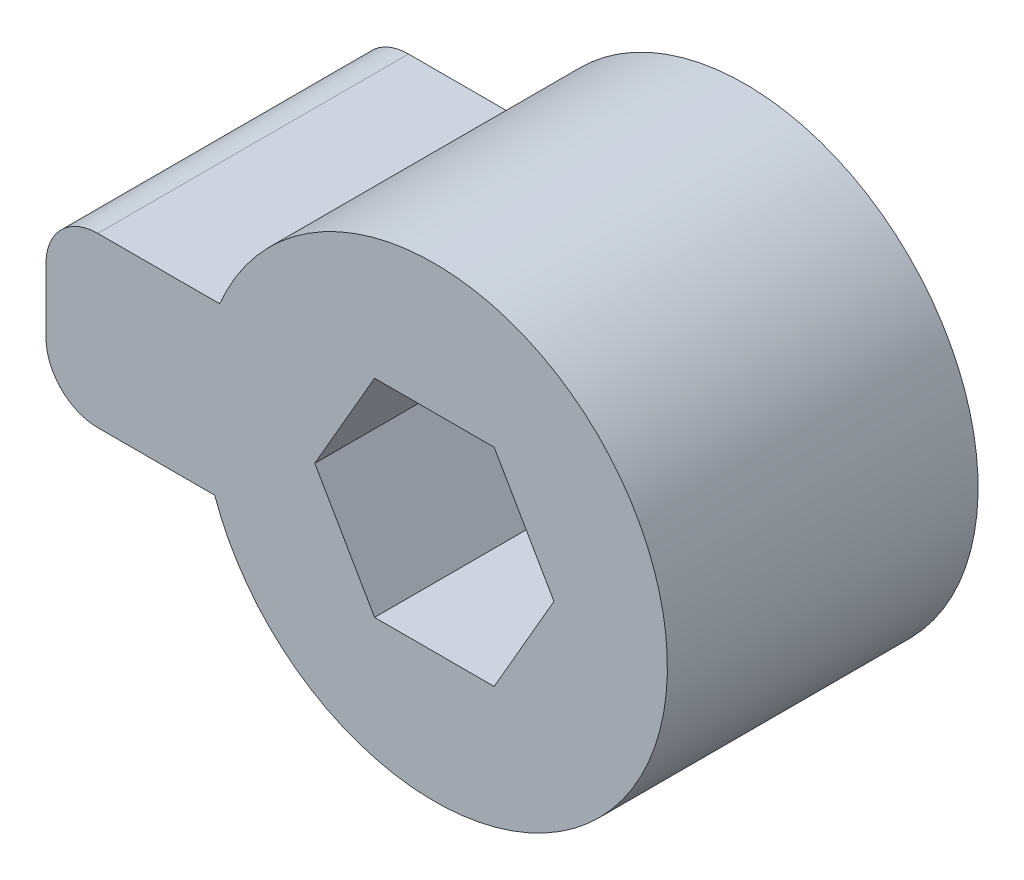
ISO-10303-21;
HEADER;
FILE_DESCRIPTION(('STEP AP214'),'2;1');
FILE_NAME('part.step','',(''),(''),'','','');
FILE_SCHEMA(('AUTOMOTIVE_DESIGN { 1 0 10303 214 1 1 1 1 }'));
ENDSEC;
DATA;
#1=APPLICATION_CONTEXT('core data for automotive mechanical design processes');
#2=APPLICATION_PROTOCOL_DEFINITION('international standard','automotive_design',2000,#1);
#3=PRODUCT_CONTEXT('',#1,'mechanical');
#4=PRODUCT('Part','Part','',(#3));
#5=PRODUCT_RELATED_PRODUCT_CATEGORY('part','',(#4));
#6=PRODUCT_DEFINITION_FORMATION('','',#4);
#7=PRODUCT_DEFINITION_CONTEXT('part definition',#1,'design');
#8=PRODUCT_DEFINITION('design','',#6,#7);
#9=PRODUCT_DEFINITION_SHAPE('','',#8);
#10=(LENGTH_UNIT() NAMED_UNIT(*) SI_UNIT(.MILLI.,.METRE.));
#11=(NAMED_UNIT(*) PLANE_ANGLE_UNIT() SI_UNIT($,.RADIAN.));
#12=(NAMED_UNIT(*) SI_UNIT($,.STERADIAN.) SOLID_ANGLE_UNIT());
#13=UNCERTAINTY_MEASURE_WITH_UNIT(LENGTH_MEASURE(1.E-05),#10,'distance_accuracy_value','');
#14=(GEOMETRIC_REPRESENTATION_CONTEXT(3) GLOBAL_UNCERTAINTY_ASSIGNED_CONTEXT((#13)) GLOBAL_UNIT_ASSIGNED_CONTEXT((#10,
#11,#12)) REPRESENTATION_CONTEXT('',''));
#15=CARTESIAN_POINT('',(0.,0.,0.));
#16=DIRECTION('',(0.,0.,1.));
#17=DIRECTION('',(1.,0.,0.));
#18=AXIS2_PLACEMENT_3D('',#15,#16,#17);
#19=CARTESIAN_POINT('',(5.54937668236868,2.,6.));
#20=DIRECTION('',(0.,0.,-1.));
#21=DIRECTION('',(-1.,0.,0.));
#22=AXIS2_PLACEMENT_3D('',#19,#20,#21);
#23=CYLINDRICAL_SURFACE('',#22,4.5);
#24=DIRECTION('',(0.,0.,-1.));
#25=VECTOR('',#24,1.);
#26=CARTESIAN_POINT('',(1.30673599524939,0.5,6.));
#27=LINE('',#26,#25);
#28=CARTESIAN_POINT('',(1.30673599524939,0.5,0.));
#29=VERTEX_POINT('',#28);
#30=CARTESIAN_POINT('',(1.30673599524939,0.5,6.));
#31=VERTEX_POINT('',#30);
#32=EDGE_CURVE('E135',#29,#31,#27,.F.);
#33=ORIENTED_EDGE('',*,*,#32,.F.);
#34=CARTESIAN_POINT('',(5.54937668236868,2.,0.));
#35=DIRECTION('',(0.,0.,1.));
#36=DIRECTION('',(1.,0.,0.));
#37=AXIS2_PLACEMENT_3D('',#34,#35,#36);
#38=CIRCLE('',#37,4.5);
#39=CARTESIAN_POINT('',(1.40359569442443,3.75,0.));
#40=VERTEX_POINT('',#39);
#41=EDGE_CURVE('E141',#29,#40,#38,.T.);
#42=ORIENTED_EDGE('',*,*,#41,.T.);
#43=DIRECTION('',(0.,0.,-1.));
#44=VECTOR('',#43,1.);
#45=CARTESIAN_POINT('',(1.40359569442443,3.75,6.));
#46=LINE('',#45,#44);
#47=CARTESIAN_POINT('',(1.40359569442443,3.75,6.));
#48=VERTEX_POINT('',#47);
#49=EDGE_CURVE('E123',#40,#48,#46,.F.);
#50=ORIENTED_EDGE('',*,*,#49,.T.);
#51=CARTESIAN_POINT('',(5.54937668236868,2.,6.));
#52=DIRECTION('',(0.,0.,1.));
#53=DIRECTION('',(1.,0.,0.));
#54=AXIS2_PLACEMENT_3D('',#51,#52,#53);
#55=CIRCLE('',#54,4.5);
#56=EDGE_CURVE('E136',#31,#48,#55,.T.);
#57=ORIENTED_EDGE('',*,*,#56,.F.);
#58=EDGE_LOOP('',(#33,#42,#50,#57));
#59=FACE_BOUND('',#58,.T.);
#60=ADVANCED_FACE('F33',(#59),#23,.T.);
#61=CARTESIAN_POINT('',(5.54937668236868,2.,6.));
#62=DIRECTION('',(0.,0.,1.));
#63=DIRECTION('',(1.,0.,0.));
#64=AXIS2_PLACEMENT_3D('',#61,#62,#63);
#65=PLANE('',#64);
#66=DIRECTION('',(0.499999999999998,-0.86602540378444,0.));
#67=VECTOR('',#66,1.);
#68=CARTESIAN_POINT('',(3.23997560561017,2.00000000000001,6.));
#69=LINE('',#68,#67);
#70=CARTESIAN_POINT('',(3.23997560561017,2.00000000000001,6.));
#71=VERTEX_POINT('',#70);
#72=CARTESIAN_POINT('',(4.39467614398942,0.,6.));
#73=VERTEX_POINT('',#72);
#74=EDGE_CURVE('E184',#71,#73,#69,.T.);
#75=ORIENTED_EDGE('',*,*,#74,.F.);
#76=DIRECTION('',(-0.500000000000004,-0.866025403784436,0.));
#77=VECTOR('',#76,1.);
#78=CARTESIAN_POINT('',(4.39467614398944,4.00000000000001,6.));
#79=LINE('',#78,#77);
#80=CARTESIAN_POINT('',(4.39467614398944,4.00000000000001,6.));
#81=VERTEX_POINT('',#80);
#82=EDGE_CURVE('E196',#81,#71,#79,.T.);
#83=ORIENTED_EDGE('',*,*,#82,.F.);
#84=DIRECTION('',(-1.,0.,0.));
#85=VECTOR('',#84,1.);
#86=CARTESIAN_POINT('',(6.70407722074795,3.99999999999999,6.));
#87=LINE('',#86,#85);
#88=CARTESIAN_POINT('',(6.70407722074795,3.99999999999999,6.));
#89=VERTEX_POINT('',#88);
#90=EDGE_CURVE('E193',#89,#81,#87,.T.);
#91=ORIENTED_EDGE('',*,*,#90,.F.);
#92=DIRECTION('',(-0.499999999999992,0.866025403784443,0.));
#93=VECTOR('',#92,1.);
#94=CARTESIAN_POINT('',(7.85877775912718,1.99999999999998,6.));
#95=LINE('',#94,#93);
#96=CARTESIAN_POINT('',(7.85877775912718,1.99999999999998,6.));
#97=VERTEX_POINT('',#96);
#98=EDGE_CURVE('E191',#97,#89,#95,.T.);
#99=ORIENTED_EDGE('',*,*,#98,.F.);
#100=DIRECTION('',(0.50000000000001,0.866025403784433,0.));
#101=VECTOR('',#100,1.);
#102=CARTESIAN_POINT('',(6.70407722074791,0.,6.));
#103=LINE('',#102,#101);
#104=CARTESIAN_POINT('',(6.70407722074791,0.,6.));
#105=VERTEX_POINT('',#104);
#106=EDGE_CURVE('E189',#105,#97,#103,.T.);
#107=ORIENTED_EDGE('',*,*,#106,.F.);
#108=DIRECTION('',(1.,0.,0.));
#109=VECTOR('',#108,1.);
#110=CARTESIAN_POINT('',(4.39467614398942,0.,6.));
#111=LINE('',#110,#109);
#112=EDGE_CURVE('E186',#73,#105,#111,.T.);
#113=ORIENTED_EDGE('',*,*,#112,.F.);
#114=EDGE_LOOP('',(#75,#83,#91,#99,#107,#113));
#115=FACE_BOUND('',#114,.T.);
#116=DIRECTION('',(1.,0.,0.));
#117=VECTOR('',#116,1.);
#118=CARTESIAN_POINT('',(-1.95062331763132,3.75,6.));
#119=LINE('',#118,#117);
#120=CARTESIAN_POINT('',(-0.950623317631324,3.75,6.));
#121=VERTEX_POINT('',#120);
#122=EDGE_CURVE('E130',#121,#48,#119,.T.);
#123=ORIENTED_EDGE('',*,*,#122,.F.);
#124=CARTESIAN_POINT('',(-0.950623317631324,2.75,6.));
#125=DIRECTION('',(0.,0.,1.));
#126=DIRECTION('',(1.,0.,0.));
#127=AXIS2_PLACEMENT_3D('',#124,#125,#126);
#128=CIRCLE('',#127,1.);
#129=CARTESIAN_POINT('',(-1.95062331763132,2.75,6.));
#130=VERTEX_POINT('',#129);
#131=EDGE_CURVE('E158',#121,#130,#128,.T.);
#132=ORIENTED_EDGE('',*,*,#131,.T.);
#133=DIRECTION('',(0.,1.,0.));
#134=VECTOR('',#133,1.);
#135=CARTESIAN_POINT('',(-1.95062331763132,0.5,6.));
#136=LINE('',#135,#134);
#137=CARTESIAN_POINT('',(-1.95062331763132,1.5,6.));
#138=VERTEX_POINT('',#137);
#139=EDGE_CURVE('E172',#138,#130,#136,.T.);
#140=ORIENTED_EDGE('',*,*,#139,.F.);
#141=CARTESIAN_POINT('',(-0.950623317631324,1.5,6.));
#142=DIRECTION('',(0.,0.,1.));
#143=DIRECTION('',(1.,0.,0.));
#144=AXIS2_PLACEMENT_3D('',#141,#142,#143);
#145=CIRCLE('',#144,1.);
#146=CARTESIAN_POINT('',(-0.950623317631324,0.5,6.));
#147=VERTEX_POINT('',#146);
#148=EDGE_CURVE('E156',#138,#147,#145,.T.);
#149=ORIENTED_EDGE('',*,*,#148,.T.);
#150=DIRECTION('',(1.,0.,0.));
#151=VECTOR('',#150,1.);
#152=CARTESIAN_POINT('',(-1.95062331763132,0.5,6.));
#153=LINE('',#152,#151);
#154=EDGE_CURVE('E173',#147,#31,#153,.T.);
#155=ORIENTED_EDGE('',*,*,#154,.T.);
#156=ORIENTED_EDGE('',*,*,#56,.T.);
#157=EDGE_LOOP('',(#123,#132,#140,#149,#155,#156));
#158=FACE_BOUND('',#157,.T.);
#159=ADVANCED_FACE('F176',(#115,#158),#65,.T.);
#160=CARTESIAN_POINT('',(5.54937668236868,2.,0.));
#161=DIRECTION('',(0.,0.,1.));
#162=DIRECTION('',(1.,0.,0.));
#163=AXIS2_PLACEMENT_3D('',#160,#161,#162);
#164=PLANE('',#163);
#165=DIRECTION('',(-0.500000000000004,-0.866025403784436,0.));
#166=VECTOR('',#165,1.);
#167=CARTESIAN_POINT('',(4.39467614398944,4.00000000000001,0.));
#168=LINE('',#167,#166);
#169=CARTESIAN_POINT('',(4.39467614398944,4.00000000000001,0.));
#170=VERTEX_POINT('',#169);
#171=CARTESIAN_POINT('',(3.23997560561017,2.00000000000001,0.));
#172=VERTEX_POINT('',#171);
#173=EDGE_CURVE('E187',#170,#172,#168,.T.);
#174=ORIENTED_EDGE('',*,*,#173,.T.);
#175=DIRECTION('',(0.499999999999998,-0.86602540378444,0.));
#176=VECTOR('',#175,1.);
#177=CARTESIAN_POINT('',(3.23997560561017,2.00000000000001,0.));
#178=LINE('',#177,#176);
#179=CARTESIAN_POINT('',(4.39467614398942,0.,0.));
#180=VERTEX_POINT('',#179);
#181=EDGE_CURVE('E182',#172,#180,#178,.T.);
#182=ORIENTED_EDGE('',*,*,#181,.T.);
#183=DIRECTION('',(1.,0.,0.));
#184=VECTOR('',#183,1.);
#185=CARTESIAN_POINT('',(4.39467614398942,0.,0.));
#186=LINE('',#185,#184);
#187=CARTESIAN_POINT('',(6.70407722074791,0.,0.));
#188=VERTEX_POINT('',#187);
#189=EDGE_CURVE('E201',#180,#188,#186,.T.);
#190=ORIENTED_EDGE('',*,*,#189,.T.);
#191=DIRECTION('',(0.50000000000001,0.866025403784433,0.));
#192=VECTOR('',#191,1.);
#193=CARTESIAN_POINT('',(6.70407722074791,0.,0.));
#194=LINE('',#193,#192);
#195=CARTESIAN_POINT('',(7.85877775912718,1.99999999999998,0.));
#196=VERTEX_POINT('',#195);
#197=EDGE_CURVE('E204',#188,#196,#194,.T.);
#198=ORIENTED_EDGE('',*,*,#197,.T.);
#199=DIRECTION('',(-0.499999999999992,0.866025403784443,0.));
#200=VECTOR('',#199,1.);
#201=CARTESIAN_POINT('',(7.85877775912718,1.99999999999998,0.));
#202=LINE('',#201,#200);
#203=CARTESIAN_POINT('',(6.70407722074795,3.99999999999999,0.));
#204=VERTEX_POINT('',#203);
#205=EDGE_CURVE('E207',#196,#204,#202,.T.);
#206=ORIENTED_EDGE('',*,*,#205,.T.);
#207=DIRECTION('',(-1.,0.,0.));
#208=VECTOR('',#207,1.);
#209=CARTESIAN_POINT('',(6.70407722074795,3.99999999999999,0.));
#210=LINE('',#209,#208);
#211=EDGE_CURVE('E210',#204,#170,#210,.T.);
#212=ORIENTED_EDGE('',*,*,#211,.T.);
#213=EDGE_LOOP('',(#174,#182,#190,#198,#206,#212));
#214=FACE_BOUND('',#213,.T.);
#215=DIRECTION('',(0.,1.,0.));
#216=VECTOR('',#215,1.);
#217=CARTESIAN_POINT('',(-1.95062331763132,0.5,0.));
#218=LINE('',#217,#216);
#219=CARTESIAN_POINT('',(-1.95062331763132,1.5,0.));
#220=VERTEX_POINT('',#219);
#221=CARTESIAN_POINT('',(-1.95062331763132,2.75,0.));
#222=VERTEX_POINT('',#221);
#223=EDGE_CURVE('E166',#220,#222,#218,.T.);
#224=ORIENTED_EDGE('',*,*,#223,.T.);
#225=CARTESIAN_POINT('',(-0.950623317631324,2.75,0.));
#226=DIRECTION('',(0.,0.,1.));
#227=DIRECTION('',(1.,0.,0.));
#228=AXIS2_PLACEMENT_3D('',#225,#226,#227);
#229=CIRCLE('',#228,1.);
#230=CARTESIAN_POINT('',(-0.950623317631323,3.75,0.));
#231=VERTEX_POINT('',#230);
#232=EDGE_CURVE('E41',#222,#231,#229,.F.);
#233=ORIENTED_EDGE('',*,*,#232,.T.);
#234=DIRECTION('',(-1.,0.,0.));
#235=VECTOR('',#234,1.);
#236=CARTESIAN_POINT('',(3.23997560561017,3.75,0.));
#237=LINE('',#236,#235);
#238=EDGE_CURVE('E127',#40,#231,#237,.T.);
#239=ORIENTED_EDGE('',*,*,#238,.F.);
#240=ORIENTED_EDGE('',*,*,#41,.F.);
#241=DIRECTION('',(-1.,0.,0.));
#242=VECTOR('',#241,1.);
#243=CARTESIAN_POINT('',(3.23997560561017,0.5,0.));
#244=LINE('',#243,#242);
#245=CARTESIAN_POINT('',(-0.950623317631323,0.5,0.));
#246=VERTEX_POINT('',#245);
#247=EDGE_CURVE('E167',#29,#246,#244,.T.);
#248=ORIENTED_EDGE('',*,*,#247,.T.);
#249=CARTESIAN_POINT('',(-0.950623317631324,1.5,0.));
#250=DIRECTION('',(0.,0.,1.));
#251=DIRECTION('',(1.,0.,0.));
#252=AXIS2_PLACEMENT_3D('',#249,#250,#251);
#253=CIRCLE('',#252,1.);
#254=EDGE_CURVE('E164',#246,#220,#253,.F.);
#255=ORIENTED_EDGE('',*,*,#254,.T.);
#256=EDGE_LOOP('',(#224,#233,#239,#240,#248,#255));
#257=FACE_BOUND('',#256,.T.);
#258=ADVANCED_FACE('F140',(#214,#257),#164,.F.);
#259=CARTESIAN_POINT('',(3.23997560561017,2.00000000000001,6.));
#260=DIRECTION('',(0.86602540378444,0.499999999999998,0.));
#261=DIRECTION('',(-0.499999999999998,0.86602540378444,0.));
#262=AXIS2_PLACEMENT_3D('',#259,#260,#261);
#263=PLANE('',#262);
#264=ORIENTED_EDGE('',*,*,#181,.F.);
#265=DIRECTION('',(0.,0.,-1.));
#266=VECTOR('',#265,1.);
#267=CARTESIAN_POINT('',(3.23997560561017,2.00000000000001,6.));
#268=LINE('',#267,#266);
#269=EDGE_CURVE('E198',#71,#172,#268,.T.);
#270=ORIENTED_EDGE('',*,*,#269,.F.);
#271=ORIENTED_EDGE('',*,*,#74,.T.);
#272=DIRECTION('',(0.,0.,-1.));
#273=VECTOR('',#272,1.);
#274=CARTESIAN_POINT('',(4.39467614398942,0.,6.));
#275=LINE('',#274,#273);
#276=EDGE_CURVE('E146',#73,#180,#275,.T.);
#277=ORIENTED_EDGE('',*,*,#276,.T.);
#278=EDGE_LOOP('',(#264,#270,#271,#277));
#279=FACE_BOUND('',#278,.T.);
#280=ADVANCED_FACE('F238',(#279),#263,.T.);
#281=CARTESIAN_POINT('',(4.39467614398942,0.,6.));
#282=DIRECTION('',(0.,1.,0.));
#283=DIRECTION('',(-1.,0.,0.));
#284=AXIS2_PLACEMENT_3D('',#281,#282,#283);
#285=PLANE('',#284);
#286=ORIENTED_EDGE('',*,*,#189,.F.);
#287=ORIENTED_EDGE('',*,*,#276,.F.);
#288=ORIENTED_EDGE('',*,*,#112,.T.);
#289=DIRECTION('',(0.,0.,-1.));
#290=VECTOR('',#289,1.);
#291=CARTESIAN_POINT('',(6.70407722074791,0.,6.));
#292=LINE('',#291,#290);
#293=EDGE_CURVE('E150',#105,#188,#292,.T.);
#294=ORIENTED_EDGE('',*,*,#293,.T.);
#295=EDGE_LOOP('',(#286,#287,#288,#294));
#296=FACE_BOUND('',#295,.T.);
#297=ADVANCED_FACE('F226',(#296),#285,.T.);
#298=CARTESIAN_POINT('',(6.70407722074791,0.,6.));
#299=DIRECTION('',(-0.866025403784433,0.50000000000001,0.));
#300=DIRECTION('',(-0.50000000000001,-0.866025403784433,0.));
#301=AXIS2_PLACEMENT_3D('',#298,#299,#300);
#302=PLANE('',#301);
#303=ORIENTED_EDGE('',*,*,#197,.F.);
#304=ORIENTED_EDGE('',*,*,#293,.F.);
#305=ORIENTED_EDGE('',*,*,#106,.T.);
#306=DIRECTION('',(0.,0.,-1.));
#307=VECTOR('',#306,1.);
#308=CARTESIAN_POINT('',(7.85877775912718,1.99999999999998,6.));
#309=LINE('',#308,#307);
#310=EDGE_CURVE('E221',#97,#196,#309,.T.);
#311=ORIENTED_EDGE('',*,*,#310,.T.);
#312=EDGE_LOOP('',(#303,#304,#305,#311));
#313=FACE_BOUND('',#312,.T.);
#314=ADVANCED_FACE('F231',(#313),#302,.T.);
#315=CARTESIAN_POINT('',(7.85877775912718,1.99999999999998,6.));
#316=DIRECTION('',(-0.866025403784443,-0.499999999999992,0.));
#317=DIRECTION('',(0.499999999999992,-0.866025403784443,0.));
#318=AXIS2_PLACEMENT_3D('',#315,#316,#317);
#319=PLANE('',#318);
#320=ORIENTED_EDGE('',*,*,#205,.F.);
#321=ORIENTED_EDGE('',*,*,#310,.F.);
#322=ORIENTED_EDGE('',*,*,#98,.T.);
#323=DIRECTION('',(0.,0.,-1.));
#324=VECTOR('',#323,1.);
#325=CARTESIAN_POINT('',(6.70407722074795,3.99999999999999,6.));
#326=LINE('',#325,#324);
#327=EDGE_CURVE('E219',#89,#204,#326,.T.);
#328=ORIENTED_EDGE('',*,*,#327,.T.);
#329=EDGE_LOOP('',(#320,#321,#322,#328));
#330=FACE_BOUND('',#329,.T.);
#331=ADVANCED_FACE('F247',(#330),#319,.T.);
#332=CARTESIAN_POINT('',(6.70407722074795,3.99999999999999,6.));
#333=DIRECTION('',(0.,-1.,0.));
#334=DIRECTION('',(1.,0.,0.));
#335=AXIS2_PLACEMENT_3D('',#332,#333,#334);
#336=PLANE('',#335);
#337=ORIENTED_EDGE('',*,*,#211,.F.);
#338=ORIENTED_EDGE('',*,*,#327,.F.);
#339=ORIENTED_EDGE('',*,*,#90,.T.);
#340=DIRECTION('',(0.,0.,-1.));
#341=VECTOR('',#340,1.);
#342=CARTESIAN_POINT('',(4.39467614398944,4.00000000000001,6.));
#343=LINE('',#342,#341);
#344=EDGE_CURVE('E217',#81,#170,#343,.T.);
#345=ORIENTED_EDGE('',*,*,#344,.T.);
#346=EDGE_LOOP('',(#337,#338,#339,#345));
#347=FACE_BOUND('',#346,.T.);
#348=ADVANCED_FACE('F251',(#347),#336,.T.);
#349=CARTESIAN_POINT('',(4.39467614398944,4.00000000000001,6.));
#350=DIRECTION('',(0.866025403784436,-0.500000000000004,0.));
#351=DIRECTION('',(0.500000000000004,0.866025403784436,0.));
#352=AXIS2_PLACEMENT_3D('',#349,#350,#351);
#353=PLANE('',#352);
#354=ORIENTED_EDGE('',*,*,#173,.F.);
#355=ORIENTED_EDGE('',*,*,#344,.F.);
#356=ORIENTED_EDGE('',*,*,#82,.T.);
#357=ORIENTED_EDGE('',*,*,#269,.T.);
#358=EDGE_LOOP('',(#354,#355,#356,#357));
#359=FACE_BOUND('',#358,.T.);
#360=ADVANCED_FACE('F241',(#359),#353,.T.);
#361=CARTESIAN_POINT('',(0.,0.5,0.));
#362=DIRECTION('',(0.,1.,0.));
#363=DIRECTION('',(0.,0.,1.));
#364=AXIS2_PLACEMENT_3D('',#361,#362,#363);
#365=PLANE('',#364);
#366=ORIENTED_EDGE('',*,*,#154,.F.);
#367=DIRECTION('',(0.,0.,1.));
#368=VECTOR('',#367,1.);
#369=CARTESIAN_POINT('',(-0.950623317631324,0.5,0.));
#370=LINE('',#369,#368);
#371=EDGE_CURVE('E11',#147,#246,#370,.F.);
#372=ORIENTED_EDGE('',*,*,#371,.T.);
#373=ORIENTED_EDGE('',*,*,#247,.F.);
#374=ORIENTED_EDGE('',*,*,#32,.T.);
#375=EDGE_LOOP('',(#366,#372,#373,#374));
#376=FACE_BOUND('',#375,.T.);
#377=ADVANCED_FACE('F177',(#376),#365,.F.);
#378=CARTESIAN_POINT('',(0.,3.75,0.));
#379=DIRECTION('',(0.,1.,0.));
#380=DIRECTION('',(0.,0.,1.));
#381=AXIS2_PLACEMENT_3D('',#378,#379,#380);
#382=PLANE('',#381);
#383=ORIENTED_EDGE('',*,*,#238,.T.);
#384=DIRECTION('',(0.,0.,1.));
#385=VECTOR('',#384,1.);
#386=CARTESIAN_POINT('',(-0.950623317631324,3.75,0.));
#387=LINE('',#386,#385);
#388=EDGE_CURVE('E154',#231,#121,#387,.T.);
#389=ORIENTED_EDGE('',*,*,#388,.T.);
#390=ORIENTED_EDGE('',*,*,#122,.T.);
#391=ORIENTED_EDGE('',*,*,#49,.F.);
#392=EDGE_LOOP('',(#383,#389,#390,#391));
#393=FACE_BOUND('',#392,.T.);
#394=ADVANCED_FACE('F125',(#393),#382,.T.);
#395=CARTESIAN_POINT('',(-1.95062331763132,0.5,0.));
#396=DIRECTION('',(-1.,0.,0.));
#397=DIRECTION('',(0.,0.,1.));
#398=AXIS2_PLACEMENT_3D('',#395,#396,#397);
#399=PLANE('',#398);
#400=ORIENTED_EDGE('',*,*,#139,.T.);
#401=DIRECTION('',(0.,0.,1.));
#402=VECTOR('',#401,1.);
#403=CARTESIAN_POINT('',(-1.95062331763132,2.75,0.));
#404=LINE('',#403,#402);
#405=EDGE_CURVE('E54',#130,#222,#404,.F.);
#406=ORIENTED_EDGE('',*,*,#405,.T.);
#407=ORIENTED_EDGE('',*,*,#223,.F.);
#408=DIRECTION('',(0.,0.,1.));
#409=VECTOR('',#408,1.);
#410=CARTESIAN_POINT('',(-1.95062331763132,1.5,6.));
#411=LINE('',#410,#409);
#412=EDGE_CURVE('E160',#220,#138,#411,.T.);
#413=ORIENTED_EDGE('',*,*,#412,.T.);
#414=EDGE_LOOP('',(#400,#406,#407,#413));
#415=FACE_BOUND('',#414,.T.);
#416=ADVANCED_FACE('F170',(#415),#399,.T.);
#417=CARTESIAN_POINT('',(-0.950623317631324,2.75,0.));
#418=DIRECTION('',(0.,0.,1.));
#419=DIRECTION('',(1.,0.,0.));
#420=AXIS2_PLACEMENT_3D('',#417,#418,#419);
#421=CYLINDRICAL_SURFACE('',#420,1.);
#422=ORIENTED_EDGE('',*,*,#232,.F.);
#423=ORIENTED_EDGE('',*,*,#405,.F.);
#424=ORIENTED_EDGE('',*,*,#131,.F.);
#425=ORIENTED_EDGE('',*,*,#388,.F.);
#426=EDGE_LOOP('',(#422,#423,#424,#425));
#427=FACE_BOUND('',#426,.T.);
#428=ADVANCED_FACE('F267',(#427),#421,.T.);
#429=CARTESIAN_POINT('',(-0.950623317631324,1.5,0.));
#430=DIRECTION('',(0.,0.,-1.));
#431=DIRECTION('',(-1.,0.,0.));
#432=AXIS2_PLACEMENT_3D('',#429,#430,#431);
#433=CYLINDRICAL_SURFACE('',#432,1.);
#434=ORIENTED_EDGE('',*,*,#254,.F.);
#435=ORIENTED_EDGE('',*,*,#371,.F.);
#436=ORIENTED_EDGE('',*,*,#148,.F.);
#437=ORIENTED_EDGE('',*,*,#412,.F.);
#438=EDGE_LOOP('',(#434,#435,#436,#437));
#439=FACE_BOUND('',#438,.T.);
#440=ADVANCED_FACE('F35',(#439),#433,.T.);
#441=CLOSED_SHELL('',(#60,#159,#258,#280,#297,#314,#331,#348,#360,#377,#394,#416,#428,#440));
#442=MANIFOLD_SOLID_BREP('B2',#441);
#443=ADVANCED_BREP_SHAPE_REPRESENTATION('',(#18,#442),#14);
#444=SHAPE_DEFINITION_REPRESENTATION(#9,#443);
ENDSEC;
END-ISO-10303-21;
